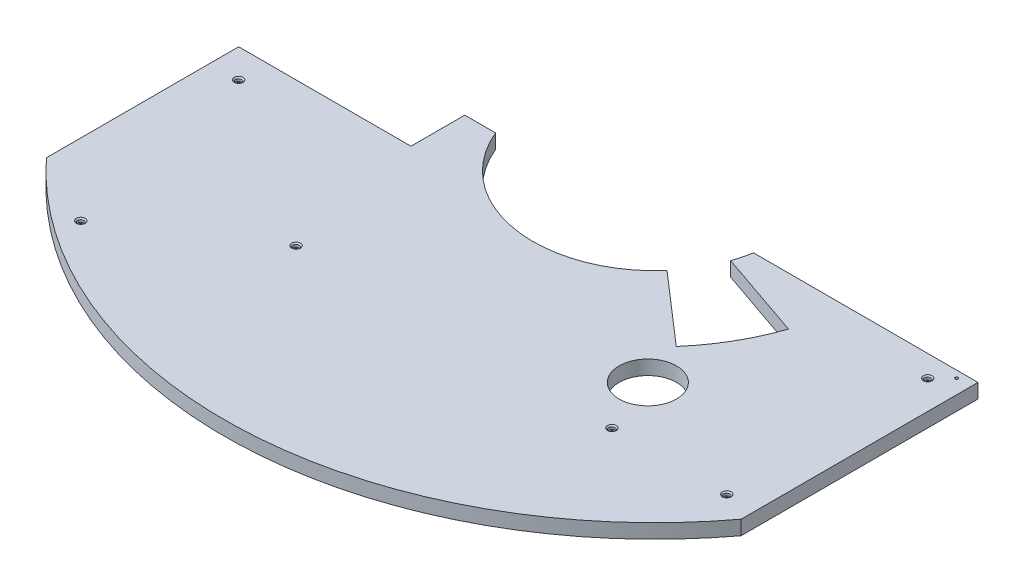
ISO-10303-21;
HEADER;
FILE_DESCRIPTION(('STEP AP214'),'2;1');
FILE_NAME('part.step','',(''),(''),'','','');
FILE_SCHEMA(('AUTOMOTIVE_DESIGN { 1 0 10303 214 1 1 1 1 }'));
ENDSEC;
DATA;
#1=APPLICATION_CONTEXT('core data for automotive mechanical design processes');
#2=APPLICATION_PROTOCOL_DEFINITION('international standard','automotive_design',2000,#1);
#3=PRODUCT_CONTEXT('',#1,'mechanical');
#4=PRODUCT('Part','Part','',(#3));
#5=PRODUCT_RELATED_PRODUCT_CATEGORY('part','',(#4));
#6=PRODUCT_DEFINITION_FORMATION('','',#4);
#7=PRODUCT_DEFINITION_CONTEXT('part definition',#1,'design');
#8=PRODUCT_DEFINITION('design','',#6,#7);
#9=PRODUCT_DEFINITION_SHAPE('','',#8);
#10=(LENGTH_UNIT() NAMED_UNIT(*) SI_UNIT(.MILLI.,.METRE.));
#11=(NAMED_UNIT(*) PLANE_ANGLE_UNIT() SI_UNIT($,.RADIAN.));
#12=(NAMED_UNIT(*) SI_UNIT($,.STERADIAN.) SOLID_ANGLE_UNIT());
#13=UNCERTAINTY_MEASURE_WITH_UNIT(LENGTH_MEASURE(1.E-05),#10,'distance_accuracy_value','');
#14=(GEOMETRIC_REPRESENTATION_CONTEXT(3) GLOBAL_UNCERTAINTY_ASSIGNED_CONTEXT((#13)) GLOBAL_UNIT_ASSIGNED_CONTEXT((#10,
#11,#12)) REPRESENTATION_CONTEXT('',''));
#15=CARTESIAN_POINT('',(0.,0.,0.));
#16=DIRECTION('',(0.,0.,1.));
#17=DIRECTION('',(1.,0.,0.));
#18=AXIS2_PLACEMENT_3D('',#15,#16,#17);
#19=CARTESIAN_POINT('',(152.22024857908,0.,-524.454782608696));
#20=DIRECTION('',(0.,1.,0.));
#21=DIRECTION('',(0.,0.,1.));
#22=AXIS2_PLACEMENT_3D('',#19,#20,#21);
#23=CYLINDRICAL_SURFACE('',#22,215.9);
#24=CARTESIAN_POINT('',(152.22024857908,25.4,-524.454782608696));
#25=DIRECTION('',(0.,1.,0.));
#26=DIRECTION('',(0.,0.,1.));
#27=AXIS2_PLACEMENT_3D('',#24,#25,#26);
#28=CIRCLE('',#27,215.9);
#29=CARTESIAN_POINT('',(-47.2748829404633,25.4,-441.904782608696));
#30=VERTEX_POINT('',#29);
#31=CARTESIAN_POINT('',(315.162046949177,25.4,-382.811638249646));
#32=VERTEX_POINT('',#31);
#33=EDGE_CURVE('E206',#30,#32,#28,.T.);
#34=ORIENTED_EDGE('',*,*,#33,.T.);
#35=DIRECTION('',(0.,1.,0.));
#36=VECTOR('',#35,1.);
#37=CARTESIAN_POINT('',(315.162046949177,0.,-382.811638249646));
#38=LINE('',#37,#36);
#39=CARTESIAN_POINT('',(315.162046949177,0.,-382.811638249646));
#40=VERTEX_POINT('',#39);
#41=EDGE_CURVE('E11',#32,#40,#38,.F.);
#42=ORIENTED_EDGE('',*,*,#41,.T.);
#43=CARTESIAN_POINT('',(152.22024857908,0.,-524.454782608696));
#44=DIRECTION('',(0.,1.,0.));
#45=DIRECTION('',(0.,0.,1.));
#46=AXIS2_PLACEMENT_3D('',#43,#44,#45);
#47=CIRCLE('',#46,215.9);
#48=CARTESIAN_POINT('',(-47.2748829404633,0.,-441.904782608696));
#49=VERTEX_POINT('',#48);
#50=EDGE_CURVE('E201',#49,#40,#47,.T.);
#51=ORIENTED_EDGE('',*,*,#50,.F.);
#52=DIRECTION('',(0.,1.,0.));
#53=VECTOR('',#52,1.);
#54=CARTESIAN_POINT('',(-47.2748829404633,0.,-441.904782608696));
#55=LINE('',#54,#53);
#56=EDGE_CURVE('E227',#49,#30,#55,.T.);
#57=ORIENTED_EDGE('',*,*,#56,.T.);
#58=EDGE_LOOP('',(#34,#42,#51,#57));
#59=FACE_BOUND('',#58,.T.);
#60=ADVANCED_FACE('F34',(#59),#23,.F.);
#61=CARTESIAN_POINT('',(-406.57975142092,25.4,-524.454782608696));
#62=DIRECTION('',(1.,0.,0.));
#63=DIRECTION('',(0.,0.,-1.));
#64=AXIS2_PLACEMENT_3D('',#61,#62,#63);
#65=PLANE('',#64);
#66=DIRECTION('',(0.,0.,1.));
#67=VECTOR('',#66,1.);
#68=CARTESIAN_POINT('',(-406.57975142092,0.,-524.454782608696));
#69=LINE('',#68,#67);
#70=CARTESIAN_POINT('',(-406.57975142092,0.,-346.654782608696));
#71=VERTEX_POINT('',#70);
#72=CARTESIAN_POINT('',(-406.57975142092,0.,-6.39440002766822));
#73=VERTEX_POINT('',#72);
#74=EDGE_CURVE('E221',#71,#73,#69,.T.);
#75=ORIENTED_EDGE('',*,*,#74,.T.);
#76=DIRECTION('',(0.,1.,0.));
#77=VECTOR('',#76,1.);
#78=CARTESIAN_POINT('',(-406.57975142092,0.,-6.39440002766822));
#79=LINE('',#78,#77);
#80=CARTESIAN_POINT('',(-406.57975142092,25.4,-6.39440002766822));
#81=VERTEX_POINT('',#80);
#82=EDGE_CURVE('E49',#73,#81,#79,.T.);
#83=ORIENTED_EDGE('',*,*,#82,.T.);
#84=DIRECTION('',(0.,0.,1.));
#85=VECTOR('',#84,1.);
#86=CARTESIAN_POINT('',(-406.57975142092,25.4,-524.454782608696));
#87=LINE('',#86,#85);
#88=CARTESIAN_POINT('',(-406.57975142092,25.4,-346.654782608696));
#89=VERTEX_POINT('',#88);
#90=EDGE_CURVE('E224',#89,#81,#87,.T.);
#91=ORIENTED_EDGE('',*,*,#90,.F.);
#92=DIRECTION('',(0.,1.,0.));
#93=VECTOR('',#92,1.);
#94=CARTESIAN_POINT('',(-406.57975142092,0.,-346.654782608696));
#95=LINE('',#94,#93);
#96=EDGE_CURVE('E187',#71,#89,#95,.T.);
#97=ORIENTED_EDGE('',*,*,#96,.F.);
#98=EDGE_LOOP('',(#75,#83,#91,#97));
#99=FACE_BOUND('',#98,.T.);
#100=ADVANCED_FACE('F36',(#99),#65,.F.);
#101=CARTESIAN_POINT('',(0.,25.4,0.));
#102=DIRECTION('',(0.,1.,0.));
#103=DIRECTION('',(0.,0.,1.));
#104=AXIS2_PLACEMENT_3D('',#101,#102,#103);
#105=PLANE('',#104);
#106=CARTESIAN_POINT('',(-50.9797514209197,25.4,-92.6547826086957));
#107=DIRECTION('',(0.,1.,0.));
#108=DIRECTION('',(0.,0.,1.));
#109=AXIS2_PLACEMENT_3D('',#106,#107,#108);
#110=CIRCLE('',#109,7.77875);
#111=CARTESIAN_POINT('',(-50.9797514209197,25.4,-84.8760326086957));
#112=VERTEX_POINT('',#111);
#113=EDGE_CURVE('E402',#112,#112,#110,.T.);
#114=ORIENTED_EDGE('',*,*,#113,.F.);
#115=EDGE_LOOP('',(#114));
#116=FACE_BOUND('',#115,.T.);
#117=CARTESIAN_POINT('',(507.82024857908,25.4,-92.6547826086957));
#118=DIRECTION('',(0.,1.,0.));
#119=DIRECTION('',(0.,0.,1.));
#120=AXIS2_PLACEMENT_3D('',#117,#118,#119);
#121=CIRCLE('',#120,7.77874999999995);
#122=CARTESIAN_POINT('',(507.82024857908,25.4,-84.8760326086958));
#123=VERTEX_POINT('',#122);
#124=EDGE_CURVE('E416',#123,#123,#121,.T.);
#125=ORIENTED_EDGE('',*,*,#124,.F.);
#126=EDGE_LOOP('',(#125));
#127=FACE_BOUND('',#126,.T.);
#128=CARTESIAN_POINT('',(-355.77975142092,25.4,-295.854782608696));
#129=DIRECTION('',(0.,1.,0.));
#130=DIRECTION('',(0.,0.,1.));
#131=AXIS2_PLACEMENT_3D('',#128,#129,#130);
#132=CIRCLE('',#131,7.77875);
#133=CARTESIAN_POINT('',(-355.77975142092,25.4,-288.076032608696));
#134=VERTEX_POINT('',#133);
#135=EDGE_CURVE('E431',#134,#134,#132,.T.);
#136=ORIENTED_EDGE('',*,*,#135,.F.);
#137=EDGE_LOOP('',(#136));
#138=FACE_BOUND('',#137,.T.);
#139=CARTESIAN_POINT('',(-279.57975142092,25.4,59.7452173913043));
#140=DIRECTION('',(0.,1.,0.));
#141=DIRECTION('',(0.,0.,1.));
#142=AXIS2_PLACEMENT_3D('',#139,#140,#141);
#143=CIRCLE('',#142,7.77875);
#144=CARTESIAN_POINT('',(-279.57975142092,25.4,67.5239673913043));
#145=VERTEX_POINT('',#144);
#146=EDGE_CURVE('E446',#145,#145,#143,.T.);
#147=ORIENTED_EDGE('',*,*,#146,.F.);
#148=EDGE_LOOP('',(#147));
#149=FACE_BOUND('',#148,.T.);
#150=CARTESIAN_POINT('',(711.020248579081,25.4,-448.254782608696));
#151=DIRECTION('',(0.,1.,0.));
#152=DIRECTION('',(0.,0.,1.));
#153=AXIS2_PLACEMENT_3D('',#150,#151,#152);
#154=CIRCLE('',#153,7.77874999999995);
#155=CARTESIAN_POINT('',(711.020248579081,25.4,-440.476032608696));
#156=VERTEX_POINT('',#155);
#157=EDGE_CURVE('E461',#156,#156,#154,.T.);
#158=ORIENTED_EDGE('',*,*,#157,.F.);
#159=EDGE_LOOP('',(#158));
#160=FACE_BOUND('',#159,.T.);
#161=CARTESIAN_POINT('',(711.020248579081,25.4,-92.6547826086957));
#162=DIRECTION('',(0.,1.,0.));
#163=DIRECTION('',(0.,0.,1.));
#164=AXIS2_PLACEMENT_3D('',#161,#162,#163);
#165=CIRCLE('',#164,7.77874999999995);
#166=CARTESIAN_POINT('',(711.020248579081,25.4,-84.8760326086958));
#167=VERTEX_POINT('',#166);
#168=EDGE_CURVE('E476',#167,#167,#165,.T.);
#169=ORIENTED_EDGE('',*,*,#168,.F.);
#170=EDGE_LOOP('',(#169));
#171=FACE_BOUND('',#170,.T.);
#172=CARTESIAN_POINT('',(152.22024857908,25.4,-524.454782608696));
#173=DIRECTION('',(0.,-1.,0.));
#174=DIRECTION('',(0.,0.,1.));
#175=AXIS2_PLACEMENT_3D('',#172,#173,#174);
#176=CIRCLE('',#175,762.);
#177=CARTESIAN_POINT('',(761.820248579081,25.4,-67.2547826086957));
#178=VERTEX_POINT('',#177);
#179=EDGE_CURVE('E129',#178,#81,#176,.T.);
#180=ORIENTED_EDGE('',*,*,#179,.F.);
#181=DIRECTION('',(0.,0.,1.));
#182=VECTOR('',#181,1.);
#183=CARTESIAN_POINT('',(761.820248579081,25.4,-67.2547826086957));
#184=LINE('',#183,#182);
#185=CARTESIAN_POINT('',(761.820248579081,25.4,-486.354782608696));
#186=VERTEX_POINT('',#185);
#187=EDGE_CURVE('E137',#186,#178,#184,.T.);
#188=ORIENTED_EDGE('',*,*,#187,.F.);
#189=DIRECTION('',(1.,0.,0.));
#190=VECTOR('',#189,1.);
#191=CARTESIAN_POINT('',(364.731895318735,25.4,-486.354782608696));
#192=LINE('',#191,#190);
#193=CARTESIAN_POINT('',(364.731895318735,25.4,-486.354782608696));
#194=VERTEX_POINT('',#193);
#195=EDGE_CURVE('E214',#194,#186,#192,.T.);
#196=ORIENTED_EDGE('',*,*,#195,.F.);
#197=CARTESIAN_POINT('',(356.357709050973,25.4,-454.164618061396));
#198=VERTEX_POINT('',#197);
#199=EDGE_CURVE('E199',#198,#194,#28,.T.);
#200=ORIENTED_EDGE('',*,*,#199,.F.);
#201=DIRECTION('',(-0.945518575599317,0.,-0.325568154457157));
#202=VECTOR('',#201,1.);
#203=CARTESIAN_POINT('',(512.46282588242,25.4,-400.413315760519));
#204=LINE('',#203,#202);
#205=CARTESIAN_POINT('',(512.46282588242,25.4,-400.413315760519));
#206=VERTEX_POINT('',#205);
#207=EDGE_CURVE('E57',#206,#198,#204,.T.);
#208=ORIENTED_EDGE('',*,*,#207,.F.);
#209=CARTESIAN_POINT('',(152.22024857908,25.4,-524.454782608696));
#210=DIRECTION('',(0.,1.,0.));
#211=DIRECTION('',(0.,0.,1.));
#212=AXIS2_PLACEMENT_3D('',#209,#210,#211);
#213=CIRCLE('',#212,381.);
#214=CARTESIAN_POINT('',(439.764598643958,25.4,-274.496292563314));
#215=VERTEX_POINT('',#214);
#216=EDGE_CURVE('E164',#215,#206,#213,.T.);
#217=ORIENTED_EDGE('',*,*,#216,.F.);
#218=DIRECTION('',(0.754709580222775,0.,0.656059028990503));
#219=VECTOR('',#218,1.);
#220=CARTESIAN_POINT('',(152.22024857908,25.4,-524.454782608696));
#221=LINE('',#220,#219);
#222=EDGE_CURVE('E152',#32,#215,#221,.T.);
#223=ORIENTED_EDGE('',*,*,#222,.F.);
#224=ORIENTED_EDGE('',*,*,#33,.F.);
#225=DIRECTION('',(1.,0.,0.));
#226=VECTOR('',#225,1.);
#227=CARTESIAN_POINT('',(-406.57975142092,25.4,-441.904782608696));
#228=LINE('',#227,#226);
#229=CARTESIAN_POINT('',(-101.77975142092,25.4,-441.904782608696));
#230=VERTEX_POINT('',#229);
#231=EDGE_CURVE('E194',#230,#30,#228,.T.);
#232=ORIENTED_EDGE('',*,*,#231,.F.);
#233=DIRECTION('',(0.,0.,-1.));
#234=VECTOR('',#233,1.);
#235=CARTESIAN_POINT('',(-101.77975142092,25.4,-346.654782608696));
#236=LINE('',#235,#234);
#237=CARTESIAN_POINT('',(-101.77975142092,25.4,-346.654782608696));
#238=VERTEX_POINT('',#237);
#239=EDGE_CURVE('E170',#238,#230,#236,.T.);
#240=ORIENTED_EDGE('',*,*,#239,.F.);
#241=DIRECTION('',(1.,0.,0.));
#242=VECTOR('',#241,1.);
#243=CARTESIAN_POINT('',(-101.77975142092,25.4,-346.654782608696));
#244=LINE('',#243,#242);
#245=EDGE_CURVE('E177',#89,#238,#244,.T.);
#246=ORIENTED_EDGE('',*,*,#245,.F.);
#247=ORIENTED_EDGE('',*,*,#90,.T.);
#248=EDGE_LOOP('',(#180,#188,#196,#200,#208,#217,#223,#224,#232,#240,#246,#247));
#249=FACE_BOUND('',#248,.T.);
#250=CARTESIAN_POINT('',(469.72024857908,25.4,-194.254782608696));
#251=DIRECTION('',(0.,1.,0.));
#252=DIRECTION('',(0.,0.,1.));
#253=AXIS2_PLACEMENT_3D('',#250,#251,#252);
#254=CIRCLE('',#253,50.8000000000001);
#255=CARTESIAN_POINT('',(469.72024857908,25.4,-143.454782608696));
#256=VERTEX_POINT('',#255);
#257=EDGE_CURVE('E186',#256,#256,#254,.T.);
#258=ORIENTED_EDGE('',*,*,#257,.F.);
#259=EDGE_LOOP('',(#258));
#260=FACE_BOUND('',#259,.T.);
#261=CARTESIAN_POINT('',(736.420248579081,25.4,-473.948827926415));
#262=DIRECTION('',(0.,1.,0.));
#263=DIRECTION('',(0.,0.,1.));
#264=AXIS2_PLACEMENT_3D('',#261,#262,#263);
#265=CIRCLE('',#264,2.55269999999996);
#266=CARTESIAN_POINT('',(736.420248579081,25.4,-471.396127926415));
#267=VERTEX_POINT('',#266);
#268=EDGE_CURVE('E204',#267,#267,#265,.T.);
#269=ORIENTED_EDGE('',*,*,#268,.F.);
#270=EDGE_LOOP('',(#269));
#271=FACE_BOUND('',#270,.T.);
#272=ADVANCED_FACE('F238',(#116,#127,#138,#149,#160,#171,#249,#260,#271),#105,.T.);
#273=CARTESIAN_POINT('',(0.,0.,0.));
#274=DIRECTION('',(0.,1.,0.));
#275=DIRECTION('',(0.,0.,1.));
#276=AXIS2_PLACEMENT_3D('',#273,#274,#275);
#277=PLANE('',#276);
#278=CARTESIAN_POINT('',(-50.9797514209197,0.,-92.6547826086957));
#279=DIRECTION('',(0.,1.,0.));
#280=DIRECTION('',(0.,0.,1.));
#281=AXIS2_PLACEMENT_3D('',#278,#279,#280);
#282=CIRCLE('',#281,3.37819999999999);
#283=CARTESIAN_POINT('',(-50.9797514209197,0.,-89.2765826086957));
#284=VERTEX_POINT('',#283);
#285=EDGE_CURVE('E413',#284,#284,#282,.T.);
#286=ORIENTED_EDGE('',*,*,#285,.T.);
#287=EDGE_LOOP('',(#286));
#288=FACE_BOUND('',#287,.T.);
#289=CARTESIAN_POINT('',(507.82024857908,0.,-92.6547826086957));
#290=DIRECTION('',(0.,1.,0.));
#291=DIRECTION('',(0.,0.,1.));
#292=AXIS2_PLACEMENT_3D('',#289,#290,#291);
#293=CIRCLE('',#292,3.3782);
#294=CARTESIAN_POINT('',(507.82024857908,0.,-89.2765826086957));
#295=VERTEX_POINT('',#294);
#296=EDGE_CURVE('E428',#295,#295,#293,.T.);
#297=ORIENTED_EDGE('',*,*,#296,.T.);
#298=EDGE_LOOP('',(#297));
#299=FACE_BOUND('',#298,.T.);
#300=CARTESIAN_POINT('',(-355.77975142092,0.,-295.854782608696));
#301=DIRECTION('',(0.,1.,0.));
#302=DIRECTION('',(0.,0.,1.));
#303=AXIS2_PLACEMENT_3D('',#300,#301,#302);
#304=CIRCLE('',#303,3.3782);
#305=CARTESIAN_POINT('',(-355.77975142092,0.,-292.476582608696));
#306=VERTEX_POINT('',#305);
#307=EDGE_CURVE('E443',#306,#306,#304,.T.);
#308=ORIENTED_EDGE('',*,*,#307,.T.);
#309=EDGE_LOOP('',(#308));
#310=FACE_BOUND('',#309,.T.);
#311=CARTESIAN_POINT('',(-279.57975142092,0.,59.7452173913043));
#312=DIRECTION('',(0.,1.,0.));
#313=DIRECTION('',(0.,0.,1.));
#314=AXIS2_PLACEMENT_3D('',#311,#312,#313);
#315=CIRCLE('',#314,3.3782);
#316=CARTESIAN_POINT('',(-279.57975142092,0.,63.1234173913043));
#317=VERTEX_POINT('',#316);
#318=EDGE_CURVE('E458',#317,#317,#315,.T.);
#319=ORIENTED_EDGE('',*,*,#318,.T.);
#320=EDGE_LOOP('',(#319));
#321=FACE_BOUND('',#320,.T.);
#322=CARTESIAN_POINT('',(711.020248579081,0.,-448.254782608696));
#323=DIRECTION('',(0.,1.,0.));
#324=DIRECTION('',(0.,0.,1.));
#325=AXIS2_PLACEMENT_3D('',#322,#323,#324);
#326=CIRCLE('',#325,3.3782);
#327=CARTESIAN_POINT('',(711.020248579081,0.,-444.876582608696));
#328=VERTEX_POINT('',#327);
#329=EDGE_CURVE('E473',#328,#328,#326,.T.);
#330=ORIENTED_EDGE('',*,*,#329,.T.);
#331=EDGE_LOOP('',(#330));
#332=FACE_BOUND('',#331,.T.);
#333=CARTESIAN_POINT('',(711.020248579081,0.,-92.6547826086957));
#334=DIRECTION('',(0.,1.,0.));
#335=DIRECTION('',(0.,0.,1.));
#336=AXIS2_PLACEMENT_3D('',#333,#334,#335);
#337=CIRCLE('',#336,3.3782);
#338=CARTESIAN_POINT('',(711.020248579081,0.,-89.2765826086957));
#339=VERTEX_POINT('',#338);
#340=EDGE_CURVE('E145',#339,#339,#337,.T.);
#341=ORIENTED_EDGE('',*,*,#340,.T.);
#342=EDGE_LOOP('',(#341));
#343=FACE_BOUND('',#342,.T.);
#344=DIRECTION('',(0.,0.,1.));
#345=VECTOR('',#344,1.);
#346=CARTESIAN_POINT('',(761.820248579081,0.,-67.2547826086957));
#347=LINE('',#346,#345);
#348=CARTESIAN_POINT('',(761.820248579081,0.,-486.354782608696));
#349=VERTEX_POINT('',#348);
#350=CARTESIAN_POINT('',(761.820248579081,0.,-67.2547826086957));
#351=VERTEX_POINT('',#350);
#352=EDGE_CURVE('E134',#349,#351,#347,.T.);
#353=ORIENTED_EDGE('',*,*,#352,.T.);
#354=CARTESIAN_POINT('',(152.22024857908,0.,-524.454782608696));
#355=DIRECTION('',(0.,-1.,0.));
#356=DIRECTION('',(0.,0.,1.));
#357=AXIS2_PLACEMENT_3D('',#354,#355,#356);
#358=CIRCLE('',#357,762.);
#359=EDGE_CURVE('E121',#351,#73,#358,.T.);
#360=ORIENTED_EDGE('',*,*,#359,.T.);
#361=ORIENTED_EDGE('',*,*,#74,.F.);
#362=DIRECTION('',(1.,0.,0.));
#363=VECTOR('',#362,1.);
#364=CARTESIAN_POINT('',(-101.77975142092,0.,-346.654782608696));
#365=LINE('',#364,#363);
#366=CARTESIAN_POINT('',(-101.77975142092,0.,-346.654782608696));
#367=VERTEX_POINT('',#366);
#368=EDGE_CURVE('E176',#71,#367,#365,.T.);
#369=ORIENTED_EDGE('',*,*,#368,.T.);
#370=DIRECTION('',(0.,0.,-1.));
#371=VECTOR('',#370,1.);
#372=CARTESIAN_POINT('',(-101.77975142092,0.,-346.654782608696));
#373=LINE('',#372,#371);
#374=CARTESIAN_POINT('',(-101.77975142092,0.,-441.904782608696));
#375=VERTEX_POINT('',#374);
#376=EDGE_CURVE('E173',#367,#375,#373,.T.);
#377=ORIENTED_EDGE('',*,*,#376,.T.);
#378=DIRECTION('',(1.,0.,0.));
#379=VECTOR('',#378,1.);
#380=CARTESIAN_POINT('',(-406.57975142092,0.,-441.904782608696));
#381=LINE('',#380,#379);
#382=EDGE_CURVE('E197',#375,#49,#381,.T.);
#383=ORIENTED_EDGE('',*,*,#382,.T.);
#384=ORIENTED_EDGE('',*,*,#50,.T.);
#385=DIRECTION('',(0.754709580222775,0.,0.656059028990503));
#386=VECTOR('',#385,1.);
#387=CARTESIAN_POINT('',(152.22024857908,0.,-524.454782608696));
#388=LINE('',#387,#386);
#389=CARTESIAN_POINT('',(439.764598643958,0.,-274.496292563314));
#390=VERTEX_POINT('',#389);
#391=EDGE_CURVE('E153',#40,#390,#388,.T.);
#392=ORIENTED_EDGE('',*,*,#391,.T.);
#393=CARTESIAN_POINT('',(152.22024857908,0.,-524.454782608696));
#394=DIRECTION('',(0.,1.,0.));
#395=DIRECTION('',(0.,0.,1.));
#396=AXIS2_PLACEMENT_3D('',#393,#394,#395);
#397=CIRCLE('',#396,381.);
#398=CARTESIAN_POINT('',(512.46282588242,0.,-400.413315760519));
#399=VERTEX_POINT('',#398);
#400=EDGE_CURVE('E156',#390,#399,#397,.T.);
#401=ORIENTED_EDGE('',*,*,#400,.T.);
#402=DIRECTION('',(-0.945518575599317,0.,-0.325568154457157));
#403=VECTOR('',#402,1.);
#404=CARTESIAN_POINT('',(512.46282588242,0.,-400.413315760519));
#405=LINE('',#404,#403);
#406=CARTESIAN_POINT('',(356.357709050973,0.,-454.164618061396));
#407=VERTEX_POINT('',#406);
#408=EDGE_CURVE('E159',#399,#407,#405,.T.);
#409=ORIENTED_EDGE('',*,*,#408,.T.);
#410=CARTESIAN_POINT('',(364.731895318735,0.,-486.354782608696));
#411=VERTEX_POINT('',#410);
#412=EDGE_CURVE('E205',#407,#411,#47,.T.);
#413=ORIENTED_EDGE('',*,*,#412,.T.);
#414=DIRECTION('',(1.,0.,0.));
#415=VECTOR('',#414,1.);
#416=CARTESIAN_POINT('',(364.731895318735,0.,-486.354782608696));
#417=LINE('',#416,#415);
#418=EDGE_CURVE('E143',#411,#349,#417,.T.);
#419=ORIENTED_EDGE('',*,*,#418,.T.);
#420=EDGE_LOOP('',(#353,#360,#361,#369,#377,#383,#384,#392,#401,#409,#413,#419));
#421=FACE_BOUND('',#420,.T.);
#422=CARTESIAN_POINT('',(469.72024857908,0.,-194.254782608696));
#423=DIRECTION('',(0.,1.,0.));
#424=DIRECTION('',(0.,0.,1.));
#425=AXIS2_PLACEMENT_3D('',#422,#423,#424);
#426=CIRCLE('',#425,50.8000000000001);
#427=CARTESIAN_POINT('',(469.72024857908,0.,-143.454782608696));
#428=VERTEX_POINT('',#427);
#429=EDGE_CURVE('E191',#428,#428,#426,.T.);
#430=ORIENTED_EDGE('',*,*,#429,.T.);
#431=EDGE_LOOP('',(#430));
#432=FACE_BOUND('',#431,.T.);
#433=CARTESIAN_POINT('',(736.420248579081,0.,-473.948827926415));
#434=DIRECTION('',(0.,1.,0.));
#435=DIRECTION('',(0.,0.,1.));
#436=AXIS2_PLACEMENT_3D('',#433,#434,#435);
#437=CIRCLE('',#436,2.55269999999996);
#438=CARTESIAN_POINT('',(736.420248579081,0.,-471.396127926415));
#439=VERTEX_POINT('',#438);
#440=EDGE_CURVE('E211',#439,#439,#437,.T.);
#441=ORIENTED_EDGE('',*,*,#440,.T.);
#442=EDGE_LOOP('',(#441));
#443=FACE_BOUND('',#442,.T.);
#444=ADVANCED_FACE('F140',(#288,#299,#310,#321,#332,#343,#421,#432,#443),#277,.F.);
#445=CARTESIAN_POINT('',(364.731895318735,0.,-486.354782608696));
#446=DIRECTION('',(0.,0.,1.));
#447=DIRECTION('',(1.,0.,0.));
#448=AXIS2_PLACEMENT_3D('',#445,#446,#447);
#449=PLANE('',#448);
#450=ORIENTED_EDGE('',*,*,#195,.T.);
#451=DIRECTION('',(0.,1.,0.));
#452=VECTOR('',#451,1.);
#453=CARTESIAN_POINT('',(761.820248579081,0.,-486.354782608696));
#454=LINE('',#453,#452);
#455=EDGE_CURVE('E219',#349,#186,#454,.T.);
#456=ORIENTED_EDGE('',*,*,#455,.F.);
#457=ORIENTED_EDGE('',*,*,#418,.F.);
#458=DIRECTION('',(0.,1.,0.));
#459=VECTOR('',#458,1.);
#460=CARTESIAN_POINT('',(364.731895318735,0.,-486.354782608696));
#461=LINE('',#460,#459);
#462=EDGE_CURVE('E216',#411,#194,#461,.T.);
#463=ORIENTED_EDGE('',*,*,#462,.T.);
#464=EDGE_LOOP('',(#450,#456,#457,#463));
#465=FACE_BOUND('',#464,.T.);
#466=ADVANCED_FACE('F242',(#465),#449,.F.);
#467=CARTESIAN_POINT('',(736.420248579081,25.4,-473.948827926415));
#468=DIRECTION('',(0.,1.,0.));
#469=DIRECTION('',(0.,0.,1.));
#470=AXIS2_PLACEMENT_3D('',#467,#468,#469);
#471=CYLINDRICAL_SURFACE('',#470,2.55269999999996);
#472=ORIENTED_EDGE('',*,*,#440,.F.);
#473=EDGE_LOOP('',(#472));
#474=FACE_BOUND('',#473,.T.);
#475=ORIENTED_EDGE('',*,*,#268,.T.);
#476=EDGE_LOOP('',(#475));
#477=FACE_BOUND('',#476,.T.);
#478=ADVANCED_FACE('F244',(#474,#477),#471,.F.);
#479=ORIENTED_EDGE('',*,*,#412,.F.);
#480=DIRECTION('',(0.,1.,0.));
#481=VECTOR('',#480,1.);
#482=CARTESIAN_POINT('',(356.357709050973,0.,-454.164618061396));
#483=LINE('',#482,#481);
#484=EDGE_CURVE('E42',#407,#198,#483,.T.);
#485=ORIENTED_EDGE('',*,*,#484,.T.);
#486=ORIENTED_EDGE('',*,*,#199,.T.);
#487=ORIENTED_EDGE('',*,*,#462,.F.);
#488=EDGE_LOOP('',(#479,#485,#486,#487));
#489=FACE_BOUND('',#488,.T.);
#490=ADVANCED_FACE('F233',(#489),#23,.F.);
#491=CARTESIAN_POINT('',(-406.57975142092,0.,-441.904782608696));
#492=DIRECTION('',(0.,0.,1.));
#493=DIRECTION('',(1.,0.,0.));
#494=AXIS2_PLACEMENT_3D('',#491,#492,#493);
#495=PLANE('',#494);
#496=ORIENTED_EDGE('',*,*,#382,.F.);
#497=DIRECTION('',(0.,1.,0.));
#498=VECTOR('',#497,1.);
#499=CARTESIAN_POINT('',(-101.77975142092,0.,-441.904782608696));
#500=LINE('',#499,#498);
#501=EDGE_CURVE('E180',#375,#230,#500,.T.);
#502=ORIENTED_EDGE('',*,*,#501,.T.);
#503=ORIENTED_EDGE('',*,*,#231,.T.);
#504=ORIENTED_EDGE('',*,*,#56,.F.);
#505=EDGE_LOOP('',(#496,#502,#503,#504));
#506=FACE_BOUND('',#505,.T.);
#507=ADVANCED_FACE('F263',(#506),#495,.F.);
#508=CARTESIAN_POINT('',(469.72024857908,0.,-194.254782608696));
#509=DIRECTION('',(0.,1.,0.));
#510=DIRECTION('',(0.,0.,1.));
#511=AXIS2_PLACEMENT_3D('',#508,#509,#510);
#512=CYLINDRICAL_SURFACE('',#511,50.8000000000001);
#513=ORIENTED_EDGE('',*,*,#429,.F.);
#514=EDGE_LOOP('',(#513));
#515=FACE_BOUND('',#514,.T.);
#516=ORIENTED_EDGE('',*,*,#257,.T.);
#517=EDGE_LOOP('',(#516));
#518=FACE_BOUND('',#517,.T.);
#519=ADVANCED_FACE('F267',(#515,#518),#512,.F.);
#520=CARTESIAN_POINT('',(-101.77975142092,0.,-346.654782608696));
#521=DIRECTION('',(1.,0.,0.));
#522=DIRECTION('',(0.,0.,-1.));
#523=AXIS2_PLACEMENT_3D('',#520,#521,#522);
#524=PLANE('',#523);
#525=ORIENTED_EDGE('',*,*,#239,.T.);
#526=ORIENTED_EDGE('',*,*,#501,.F.);
#527=ORIENTED_EDGE('',*,*,#376,.F.);
#528=DIRECTION('',(0.,1.,0.));
#529=VECTOR('',#528,1.);
#530=CARTESIAN_POINT('',(-101.77975142092,0.,-346.654782608696));
#531=LINE('',#530,#529);
#532=EDGE_CURVE('E184',#367,#238,#531,.T.);
#533=ORIENTED_EDGE('',*,*,#532,.T.);
#534=EDGE_LOOP('',(#525,#526,#527,#533));
#535=FACE_BOUND('',#534,.T.);
#536=ADVANCED_FACE('F272',(#535),#524,.F.);
#537=CARTESIAN_POINT('',(-101.77975142092,0.,-346.654782608696));
#538=DIRECTION('',(0.,0.,1.));
#539=DIRECTION('',(1.,0.,0.));
#540=AXIS2_PLACEMENT_3D('',#537,#538,#539);
#541=PLANE('',#540);
#542=ORIENTED_EDGE('',*,*,#245,.T.);
#543=ORIENTED_EDGE('',*,*,#532,.F.);
#544=ORIENTED_EDGE('',*,*,#368,.F.);
#545=ORIENTED_EDGE('',*,*,#96,.T.);
#546=EDGE_LOOP('',(#542,#543,#544,#545));
#547=FACE_BOUND('',#546,.T.);
#548=ADVANCED_FACE('F279',(#547),#541,.F.);
#549=CARTESIAN_POINT('',(152.22024857908,0.,-524.454782608696));
#550=DIRECTION('',(-0.656059028990503,0.,0.754709580222775));
#551=DIRECTION('',(0.754709580222775,0.,0.656059028990503));
#552=AXIS2_PLACEMENT_3D('',#549,#550,#551);
#553=PLANE('',#552);
#554=ORIENTED_EDGE('',*,*,#222,.T.);
#555=DIRECTION('',(0.,1.,0.));
#556=VECTOR('',#555,1.);
#557=CARTESIAN_POINT('',(439.764598643958,0.,-274.496292563314));
#558=LINE('',#557,#556);
#559=EDGE_CURVE('E162',#390,#215,#558,.T.);
#560=ORIENTED_EDGE('',*,*,#559,.F.);
#561=ORIENTED_EDGE('',*,*,#391,.F.);
#562=ORIENTED_EDGE('',*,*,#41,.F.);
#563=EDGE_LOOP('',(#554,#560,#561,#562));
#564=FACE_BOUND('',#563,.T.);
#565=ADVANCED_FACE('F283',(#564),#553,.F.);
#566=CARTESIAN_POINT('',(512.46282588242,0.,-400.413315760519));
#567=DIRECTION('',(0.325568154457157,0.,-0.945518575599317));
#568=DIRECTION('',(-0.945518575599317,0.,-0.325568154457157));
#569=AXIS2_PLACEMENT_3D('',#566,#567,#568);
#570=PLANE('',#569);
#571=ORIENTED_EDGE('',*,*,#408,.F.);
#572=DIRECTION('',(0.,1.,0.));
#573=VECTOR('',#572,1.);
#574=CARTESIAN_POINT('',(512.46282588242,0.,-400.413315760519));
#575=LINE('',#574,#573);
#576=EDGE_CURVE('E168',#399,#206,#575,.T.);
#577=ORIENTED_EDGE('',*,*,#576,.T.);
#578=ORIENTED_EDGE('',*,*,#207,.T.);
#579=ORIENTED_EDGE('',*,*,#484,.F.);
#580=EDGE_LOOP('',(#571,#577,#578,#579));
#581=FACE_BOUND('',#580,.T.);
#582=ADVANCED_FACE('F287',(#581),#570,.F.);
#583=CARTESIAN_POINT('',(152.22024857908,0.,-524.454782608696));
#584=DIRECTION('',(0.,1.,0.));
#585=DIRECTION('',(0.,0.,1.));
#586=AXIS2_PLACEMENT_3D('',#583,#584,#585);
#587=CYLINDRICAL_SURFACE('',#586,381.);
#588=ORIENTED_EDGE('',*,*,#216,.T.);
#589=ORIENTED_EDGE('',*,*,#576,.F.);
#590=ORIENTED_EDGE('',*,*,#400,.F.);
#591=ORIENTED_EDGE('',*,*,#559,.T.);
#592=EDGE_LOOP('',(#588,#589,#590,#591));
#593=FACE_BOUND('',#592,.T.);
#594=ADVANCED_FACE('F289',(#593),#587,.F.);
#595=CARTESIAN_POINT('',(152.22024857908,0.,-524.454782608696));
#596=DIRECTION('',(0.,1.,0.));
#597=DIRECTION('',(0.,0.,1.));
#598=AXIS2_PLACEMENT_3D('',#595,#596,#597);
#599=CYLINDRICAL_SURFACE('',#598,762.);
#600=ORIENTED_EDGE('',*,*,#179,.T.);
#601=ORIENTED_EDGE('',*,*,#82,.F.);
#602=ORIENTED_EDGE('',*,*,#359,.F.);
#603=DIRECTION('',(0.,1.,0.));
#604=VECTOR('',#603,1.);
#605=CARTESIAN_POINT('',(761.820248579081,0.,-67.2547826086957));
#606=LINE('',#605,#604);
#607=EDGE_CURVE('E124',#351,#178,#606,.T.);
#608=ORIENTED_EDGE('',*,*,#607,.T.);
#609=EDGE_LOOP('',(#600,#601,#602,#608));
#610=FACE_BOUND('',#609,.T.);
#611=ADVANCED_FACE('F123',(#610),#599,.T.);
#612=CARTESIAN_POINT('',(761.820248579081,0.,-67.2547826086957));
#613=DIRECTION('',(-1.,0.,0.));
#614=DIRECTION('',(0.,0.,1.));
#615=AXIS2_PLACEMENT_3D('',#612,#613,#614);
#616=PLANE('',#615);
#617=ORIENTED_EDGE('',*,*,#187,.T.);
#618=ORIENTED_EDGE('',*,*,#607,.F.);
#619=ORIENTED_EDGE('',*,*,#352,.F.);
#620=ORIENTED_EDGE('',*,*,#455,.T.);
#621=EDGE_LOOP('',(#617,#618,#619,#620));
#622=FACE_BOUND('',#621,.T.);
#623=ADVANCED_FACE('F133',(#622),#616,.F.);
#624=CARTESIAN_POINT('',(711.020248579081,25.4,-92.6547826086957));
#625=DIRECTION('',(0.,1.,0.));
#626=DIRECTION('',(0.,0.,1.));
#627=AXIS2_PLACEMENT_3D('',#624,#625,#626);
#628=CYLINDRICAL_SURFACE('',#627,3.3782);
#629=ORIENTED_EDGE('',*,*,#340,.F.);
#630=EDGE_LOOP('',(#629));
#631=FACE_BOUND('',#630,.T.);
#632=CARTESIAN_POINT('',(711.020248579081,19.05,-92.6547826086957));
#633=DIRECTION('',(0.,1.,0.));
#634=DIRECTION('',(0.,0.,1.));
#635=AXIS2_PLACEMENT_3D('',#632,#633,#634);
#636=CIRCLE('',#635,3.3782);
#637=CARTESIAN_POINT('',(711.020248579081,19.05,-89.2765826086957));
#638=VERTEX_POINT('',#637);
#639=EDGE_CURVE('E484',#638,#638,#636,.T.);
#640=ORIENTED_EDGE('',*,*,#639,.T.);
#641=EDGE_LOOP('',(#640));
#642=FACE_BOUND('',#641,.T.);
#643=ADVANCED_FACE('F299',(#631,#642),#628,.F.);
#644=CARTESIAN_POINT('',(716.576498579081,19.05,-92.6547826086957));
#645=DIRECTION('',(0.,-1.,0.));
#646=DIRECTION('',(0.,0.,-1.));
#647=AXIS2_PLACEMENT_3D('',#644,#645,#646);
#648=PLANE('',#647);
#649=ORIENTED_EDGE('',*,*,#639,.F.);
#650=EDGE_LOOP('',(#649));
#651=FACE_BOUND('',#650,.T.);
#652=CARTESIAN_POINT('',(711.020248579081,19.05,-92.6547826086957));
#653=DIRECTION('',(0.,1.,0.));
#654=DIRECTION('',(0.,0.,1.));
#655=AXIS2_PLACEMENT_3D('',#652,#653,#654);
#656=CIRCLE('',#655,5.55625000000004);
#657=CARTESIAN_POINT('',(711.020248579081,19.05,-87.0985326086957));
#658=VERTEX_POINT('',#657);
#659=EDGE_CURVE('E482',#658,#658,#656,.T.);
#660=ORIENTED_EDGE('',*,*,#659,.T.);
#661=EDGE_LOOP('',(#660));
#662=FACE_BOUND('',#661,.T.);
#663=ADVANCED_FACE('F302',(#651,#662),#648,.F.);
#664=CARTESIAN_POINT('',(711.020248579081,25.4,-92.6547826086957));
#665=DIRECTION('',(0.,1.,0.));
#666=DIRECTION('',(0.,0.,1.));
#667=AXIS2_PLACEMENT_3D('',#664,#665,#666);
#668=CYLINDRICAL_SURFACE('',#667,5.55625000000004);
#669=ORIENTED_EDGE('',*,*,#659,.F.);
#670=EDGE_LOOP('',(#669));
#671=FACE_BOUND('',#670,.T.);
#672=CARTESIAN_POINT('',(711.020248579081,23.1775,-92.6547826086957));
#673=DIRECTION('',(0.,1.,0.));
#674=DIRECTION('',(0.,0.,1.));
#675=AXIS2_PLACEMENT_3D('',#672,#673,#674);
#676=CIRCLE('',#675,5.55625000000004);
#677=CARTESIAN_POINT('',(711.020248579081,23.1775,-87.0985326086957));
#678=VERTEX_POINT('',#677);
#679=EDGE_CURVE('E479',#678,#678,#676,.T.);
#680=ORIENTED_EDGE('',*,*,#679,.T.);
#681=EDGE_LOOP('',(#680));
#682=FACE_BOUND('',#681,.T.);
#683=ADVANCED_FACE('F306',(#671,#682),#668,.F.);
#684=CARTESIAN_POINT('',(711.020248579081,25.4,-92.6547826086957));
#685=DIRECTION('',(0.,1.,0.));
#686=DIRECTION('',(0.,0.,1.));
#687=AXIS2_PLACEMENT_3D('',#684,#685,#686);
#688=CONICAL_SURFACE('',#687,7.77874999999995,0.785398163397425);
#689=ORIENTED_EDGE('',*,*,#679,.F.);
#690=EDGE_LOOP('',(#689));
#691=FACE_BOUND('',#690,.T.);
#692=ORIENTED_EDGE('',*,*,#168,.T.);
#693=EDGE_LOOP('',(#692));
#694=FACE_BOUND('',#693,.T.);
#695=ADVANCED_FACE('F310',(#691,#694),#688,.F.);
#696=CARTESIAN_POINT('',(711.020248579081,25.4,-448.254782608696));
#697=DIRECTION('',(0.,1.,0.));
#698=DIRECTION('',(0.,0.,1.));
#699=AXIS2_PLACEMENT_3D('',#696,#697,#698);
#700=CYLINDRICAL_SURFACE('',#699,3.3782);
#701=ORIENTED_EDGE('',*,*,#329,.F.);
#702=EDGE_LOOP('',(#701));
#703=FACE_BOUND('',#702,.T.);
#704=CARTESIAN_POINT('',(711.020248579081,19.05,-448.254782608696));
#705=DIRECTION('',(0.,1.,0.));
#706=DIRECTION('',(0.,0.,1.));
#707=AXIS2_PLACEMENT_3D('',#704,#705,#706);
#708=CIRCLE('',#707,3.3782);
#709=CARTESIAN_POINT('',(711.020248579081,19.05,-444.876582608696));
#710=VERTEX_POINT('',#709);
#711=EDGE_CURVE('E470',#710,#710,#708,.T.);
#712=ORIENTED_EDGE('',*,*,#711,.T.);
#713=EDGE_LOOP('',(#712));
#714=FACE_BOUND('',#713,.T.);
#715=ADVANCED_FACE('F314',(#703,#714),#700,.F.);
#716=CARTESIAN_POINT('',(716.576498579081,19.05,-448.254782608696));
#717=DIRECTION('',(0.,-1.,0.));
#718=DIRECTION('',(0.,0.,-1.));
#719=AXIS2_PLACEMENT_3D('',#716,#717,#718);
#720=PLANE('',#719);
#721=ORIENTED_EDGE('',*,*,#711,.F.);
#722=EDGE_LOOP('',(#721));
#723=FACE_BOUND('',#722,.T.);
#724=CARTESIAN_POINT('',(711.020248579081,19.05,-448.254782608696));
#725=DIRECTION('',(0.,1.,0.));
#726=DIRECTION('',(0.,0.,1.));
#727=AXIS2_PLACEMENT_3D('',#724,#725,#726);
#728=CIRCLE('',#727,5.55625000000004);
#729=CARTESIAN_POINT('',(711.020248579081,19.05,-442.698532608696));
#730=VERTEX_POINT('',#729);
#731=EDGE_CURVE('E467',#730,#730,#728,.T.);
#732=ORIENTED_EDGE('',*,*,#731,.T.);
#733=EDGE_LOOP('',(#732));
#734=FACE_BOUND('',#733,.T.);
#735=ADVANCED_FACE('F318',(#723,#734),#720,.F.);
#736=CARTESIAN_POINT('',(711.020248579081,25.4,-448.254782608696));
#737=DIRECTION('',(0.,1.,0.));
#738=DIRECTION('',(0.,0.,1.));
#739=AXIS2_PLACEMENT_3D('',#736,#737,#738);
#740=CYLINDRICAL_SURFACE('',#739,5.55625000000004);
#741=ORIENTED_EDGE('',*,*,#731,.F.);
#742=EDGE_LOOP('',(#741));
#743=FACE_BOUND('',#742,.T.);
#744=CARTESIAN_POINT('',(711.020248579081,23.1775,-448.254782608696));
#745=DIRECTION('',(0.,1.,0.));
#746=DIRECTION('',(0.,0.,1.));
#747=AXIS2_PLACEMENT_3D('',#744,#745,#746);
#748=CIRCLE('',#747,5.55625000000004);
#749=CARTESIAN_POINT('',(711.020248579081,23.1775,-442.698532608696));
#750=VERTEX_POINT('',#749);
#751=EDGE_CURVE('E464',#750,#750,#748,.T.);
#752=ORIENTED_EDGE('',*,*,#751,.T.);
#753=EDGE_LOOP('',(#752));
#754=FACE_BOUND('',#753,.T.);
#755=ADVANCED_FACE('F322',(#743,#754),#740,.F.);
#756=CARTESIAN_POINT('',(711.020248579081,25.4,-448.254782608696));
#757=DIRECTION('',(0.,1.,0.));
#758=DIRECTION('',(0.,0.,1.));
#759=AXIS2_PLACEMENT_3D('',#756,#757,#758);
#760=CONICAL_SURFACE('',#759,7.77874999999995,0.785398163397425);
#761=ORIENTED_EDGE('',*,*,#751,.F.);
#762=EDGE_LOOP('',(#761));
#763=FACE_BOUND('',#762,.T.);
#764=ORIENTED_EDGE('',*,*,#157,.T.);
#765=EDGE_LOOP('',(#764));
#766=FACE_BOUND('',#765,.T.);
#767=ADVANCED_FACE('F326',(#763,#766),#760,.F.);
#768=CARTESIAN_POINT('',(-279.57975142092,25.4,59.7452173913043));
#769=DIRECTION('',(0.,1.,0.));
#770=DIRECTION('',(0.,0.,1.));
#771=AXIS2_PLACEMENT_3D('',#768,#769,#770);
#772=CYLINDRICAL_SURFACE('',#771,3.3782);
#773=ORIENTED_EDGE('',*,*,#318,.F.);
#774=EDGE_LOOP('',(#773));
#775=FACE_BOUND('',#774,.T.);
#776=CARTESIAN_POINT('',(-279.57975142092,19.05,59.7452173913043));
#777=DIRECTION('',(0.,1.,0.));
#778=DIRECTION('',(0.,0.,1.));
#779=AXIS2_PLACEMENT_3D('',#776,#777,#778);
#780=CIRCLE('',#779,3.3782);
#781=CARTESIAN_POINT('',(-279.57975142092,19.05,63.1234173913043));
#782=VERTEX_POINT('',#781);
#783=EDGE_CURVE('E455',#782,#782,#780,.T.);
#784=ORIENTED_EDGE('',*,*,#783,.T.);
#785=EDGE_LOOP('',(#784));
#786=FACE_BOUND('',#785,.T.);
#787=ADVANCED_FACE('F330',(#775,#786),#772,.F.);
#788=CARTESIAN_POINT('',(-274.02350142092,19.05,59.7452173913043));
#789=DIRECTION('',(0.,-1.,0.));
#790=DIRECTION('',(0.,0.,-1.));
#791=AXIS2_PLACEMENT_3D('',#788,#789,#790);
#792=PLANE('',#791);
#793=ORIENTED_EDGE('',*,*,#783,.F.);
#794=EDGE_LOOP('',(#793));
#795=FACE_BOUND('',#794,.T.);
#796=CARTESIAN_POINT('',(-279.57975142092,19.05,59.7452173913043));
#797=DIRECTION('',(0.,1.,0.));
#798=DIRECTION('',(0.,0.,1.));
#799=AXIS2_PLACEMENT_3D('',#796,#797,#798);
#800=CIRCLE('',#799,5.55624999999998);
#801=CARTESIAN_POINT('',(-279.57975142092,19.05,65.3014673913043));
#802=VERTEX_POINT('',#801);
#803=EDGE_CURVE('E452',#802,#802,#800,.T.);
#804=ORIENTED_EDGE('',*,*,#803,.T.);
#805=EDGE_LOOP('',(#804));
#806=FACE_BOUND('',#805,.T.);
#807=ADVANCED_FACE('F334',(#795,#806),#792,.F.);
#808=CARTESIAN_POINT('',(-279.57975142092,25.4,59.7452173913043));
#809=DIRECTION('',(0.,1.,0.));
#810=DIRECTION('',(0.,0.,1.));
#811=AXIS2_PLACEMENT_3D('',#808,#809,#810);
#812=CYLINDRICAL_SURFACE('',#811,5.55624999999998);
#813=ORIENTED_EDGE('',*,*,#803,.F.);
#814=EDGE_LOOP('',(#813));
#815=FACE_BOUND('',#814,.T.);
#816=CARTESIAN_POINT('',(-279.57975142092,23.1775,59.7452173913043));
#817=DIRECTION('',(0.,1.,0.));
#818=DIRECTION('',(0.,0.,1.));
#819=AXIS2_PLACEMENT_3D('',#816,#817,#818);
#820=CIRCLE('',#819,5.55624999999998);
#821=CARTESIAN_POINT('',(-279.57975142092,23.1775,65.3014673913043));
#822=VERTEX_POINT('',#821);
#823=EDGE_CURVE('E449',#822,#822,#820,.T.);
#824=ORIENTED_EDGE('',*,*,#823,.T.);
#825=EDGE_LOOP('',(#824));
#826=FACE_BOUND('',#825,.T.);
#827=ADVANCED_FACE('F338',(#815,#826),#812,.F.);
#828=CARTESIAN_POINT('',(-279.57975142092,25.4,59.7452173913043));
#829=DIRECTION('',(0.,1.,0.));
#830=DIRECTION('',(0.,0.,1.));
#831=AXIS2_PLACEMENT_3D('',#828,#829,#830);
#832=CONICAL_SURFACE('',#831,7.77875,0.78539816339745);
#833=ORIENTED_EDGE('',*,*,#823,.F.);
#834=EDGE_LOOP('',(#833));
#835=FACE_BOUND('',#834,.T.);
#836=ORIENTED_EDGE('',*,*,#146,.T.);
#837=EDGE_LOOP('',(#836));
#838=FACE_BOUND('',#837,.T.);
#839=ADVANCED_FACE('F342',(#835,#838),#832,.F.);
#840=CARTESIAN_POINT('',(-355.77975142092,25.4,-295.854782608696));
#841=DIRECTION('',(0.,1.,0.));
#842=DIRECTION('',(0.,0.,1.));
#843=AXIS2_PLACEMENT_3D('',#840,#841,#842);
#844=CYLINDRICAL_SURFACE('',#843,3.3782);
#845=ORIENTED_EDGE('',*,*,#307,.F.);
#846=EDGE_LOOP('',(#845));
#847=FACE_BOUND('',#846,.T.);
#848=CARTESIAN_POINT('',(-355.77975142092,19.05,-295.854782608696));
#849=DIRECTION('',(0.,1.,0.));
#850=DIRECTION('',(0.,0.,1.));
#851=AXIS2_PLACEMENT_3D('',#848,#849,#850);
#852=CIRCLE('',#851,3.3782);
#853=CARTESIAN_POINT('',(-355.77975142092,19.05,-292.476582608696));
#854=VERTEX_POINT('',#853);
#855=EDGE_CURVE('E440',#854,#854,#852,.T.);
#856=ORIENTED_EDGE('',*,*,#855,.T.);
#857=EDGE_LOOP('',(#856));
#858=FACE_BOUND('',#857,.T.);
#859=ADVANCED_FACE('F346',(#847,#858),#844,.F.);
#860=CARTESIAN_POINT('',(-350.22350142092,19.05,-295.854782608696));
#861=DIRECTION('',(0.,-1.,0.));
#862=DIRECTION('',(0.,0.,-1.));
#863=AXIS2_PLACEMENT_3D('',#860,#861,#862);
#864=PLANE('',#863);
#865=ORIENTED_EDGE('',*,*,#855,.F.);
#866=EDGE_LOOP('',(#865));
#867=FACE_BOUND('',#866,.T.);
#868=CARTESIAN_POINT('',(-355.77975142092,19.05,-295.854782608696));
#869=DIRECTION('',(0.,1.,0.));
#870=DIRECTION('',(0.,0.,1.));
#871=AXIS2_PLACEMENT_3D('',#868,#869,#870);
#872=CIRCLE('',#871,5.55624999999998);
#873=CARTESIAN_POINT('',(-355.77975142092,19.05,-290.298532608696));
#874=VERTEX_POINT('',#873);
#875=EDGE_CURVE('E437',#874,#874,#872,.T.);
#876=ORIENTED_EDGE('',*,*,#875,.T.);
#877=EDGE_LOOP('',(#876));
#878=FACE_BOUND('',#877,.T.);
#879=ADVANCED_FACE('F350',(#867,#878),#864,.F.);
#880=CARTESIAN_POINT('',(-355.77975142092,25.4,-295.854782608696));
#881=DIRECTION('',(0.,1.,0.));
#882=DIRECTION('',(0.,0.,1.));
#883=AXIS2_PLACEMENT_3D('',#880,#881,#882);
#884=CYLINDRICAL_SURFACE('',#883,5.55624999999998);
#885=ORIENTED_EDGE('',*,*,#875,.F.);
#886=EDGE_LOOP('',(#885));
#887=FACE_BOUND('',#886,.T.);
#888=CARTESIAN_POINT('',(-355.77975142092,23.1775,-295.854782608696));
#889=DIRECTION('',(0.,1.,0.));
#890=DIRECTION('',(0.,0.,1.));
#891=AXIS2_PLACEMENT_3D('',#888,#889,#890);
#892=CIRCLE('',#891,5.55624999999998);
#893=CARTESIAN_POINT('',(-355.77975142092,23.1775,-290.298532608696));
#894=VERTEX_POINT('',#893);
#895=EDGE_CURVE('E434',#894,#894,#892,.T.);
#896=ORIENTED_EDGE('',*,*,#895,.T.);
#897=EDGE_LOOP('',(#896));
#898=FACE_BOUND('',#897,.T.);
#899=ADVANCED_FACE('F354',(#887,#898),#884,.F.);
#900=CARTESIAN_POINT('',(-355.77975142092,25.4,-295.854782608696));
#901=DIRECTION('',(0.,1.,0.));
#902=DIRECTION('',(0.,0.,1.));
#903=AXIS2_PLACEMENT_3D('',#900,#901,#902);
#904=CONICAL_SURFACE('',#903,7.77875,0.78539816339745);
#905=ORIENTED_EDGE('',*,*,#895,.F.);
#906=EDGE_LOOP('',(#905));
#907=FACE_BOUND('',#906,.T.);
#908=ORIENTED_EDGE('',*,*,#135,.T.);
#909=EDGE_LOOP('',(#908));
#910=FACE_BOUND('',#909,.T.);
#911=ADVANCED_FACE('F358',(#907,#910),#904,.F.);
#912=CARTESIAN_POINT('',(507.82024857908,25.4,-92.6547826086957));
#913=DIRECTION('',(0.,1.,0.));
#914=DIRECTION('',(0.,0.,1.));
#915=AXIS2_PLACEMENT_3D('',#912,#913,#914);
#916=CYLINDRICAL_SURFACE('',#915,3.3782);
#917=ORIENTED_EDGE('',*,*,#296,.F.);
#918=EDGE_LOOP('',(#917));
#919=FACE_BOUND('',#918,.T.);
#920=CARTESIAN_POINT('',(507.82024857908,19.05,-92.6547826086957));
#921=DIRECTION('',(0.,1.,0.));
#922=DIRECTION('',(0.,0.,1.));
#923=AXIS2_PLACEMENT_3D('',#920,#921,#922);
#924=CIRCLE('',#923,3.3782);
#925=CARTESIAN_POINT('',(507.82024857908,19.05,-89.2765826086957));
#926=VERTEX_POINT('',#925);
#927=EDGE_CURVE('E425',#926,#926,#924,.T.);
#928=ORIENTED_EDGE('',*,*,#927,.T.);
#929=EDGE_LOOP('',(#928));
#930=FACE_BOUND('',#929,.T.);
#931=ADVANCED_FACE('F362',(#919,#930),#916,.F.);
#932=CARTESIAN_POINT('',(513.37649857908,19.05,-92.6547826086957));
#933=DIRECTION('',(0.,-1.,0.));
#934=DIRECTION('',(0.,0.,-1.));
#935=AXIS2_PLACEMENT_3D('',#932,#933,#934);
#936=PLANE('',#935);
#937=ORIENTED_EDGE('',*,*,#927,.F.);
#938=EDGE_LOOP('',(#937));
#939=FACE_BOUND('',#938,.T.);
#940=CARTESIAN_POINT('',(507.82024857908,19.05,-92.6547826086957));
#941=DIRECTION('',(0.,1.,0.));
#942=DIRECTION('',(0.,0.,1.));
#943=AXIS2_PLACEMENT_3D('',#940,#941,#942);
#944=CIRCLE('',#943,5.55625000000004);
#945=CARTESIAN_POINT('',(507.82024857908,19.05,-87.0985326086957));
#946=VERTEX_POINT('',#945);
#947=EDGE_CURVE('E422',#946,#946,#944,.T.);
#948=ORIENTED_EDGE('',*,*,#947,.T.);
#949=EDGE_LOOP('',(#948));
#950=FACE_BOUND('',#949,.T.);
#951=ADVANCED_FACE('F366',(#939,#950),#936,.F.);
#952=CARTESIAN_POINT('',(507.82024857908,25.4,-92.6547826086957));
#953=DIRECTION('',(0.,1.,0.));
#954=DIRECTION('',(0.,0.,1.));
#955=AXIS2_PLACEMENT_3D('',#952,#953,#954);
#956=CYLINDRICAL_SURFACE('',#955,5.55625000000004);
#957=ORIENTED_EDGE('',*,*,#947,.F.);
#958=EDGE_LOOP('',(#957));
#959=FACE_BOUND('',#958,.T.);
#960=CARTESIAN_POINT('',(507.82024857908,23.1775,-92.6547826086957));
#961=DIRECTION('',(0.,1.,0.));
#962=DIRECTION('',(0.,0.,1.));
#963=AXIS2_PLACEMENT_3D('',#960,#961,#962);
#964=CIRCLE('',#963,5.55625000000004);
#965=CARTESIAN_POINT('',(507.82024857908,23.1775,-87.0985326086957));
#966=VERTEX_POINT('',#965);
#967=EDGE_CURVE('E419',#966,#966,#964,.T.);
#968=ORIENTED_EDGE('',*,*,#967,.T.);
#969=EDGE_LOOP('',(#968));
#970=FACE_BOUND('',#969,.T.);
#971=ADVANCED_FACE('F370',(#959,#970),#956,.F.);
#972=CARTESIAN_POINT('',(507.82024857908,25.4,-92.6547826086957));
#973=DIRECTION('',(0.,1.,0.));
#974=DIRECTION('',(0.,0.,1.));
#975=AXIS2_PLACEMENT_3D('',#972,#973,#974);
#976=CONICAL_SURFACE('',#975,7.77874999999995,0.785398163397425);
#977=ORIENTED_EDGE('',*,*,#967,.F.);
#978=EDGE_LOOP('',(#977));
#979=FACE_BOUND('',#978,.T.);
#980=ORIENTED_EDGE('',*,*,#124,.T.);
#981=EDGE_LOOP('',(#980));
#982=FACE_BOUND('',#981,.T.);
#983=ADVANCED_FACE('F374',(#979,#982),#976,.F.);
#984=CARTESIAN_POINT('',(-50.9797514209197,25.4,-92.6547826086957));
#985=DIRECTION('',(0.,1.,0.));
#986=DIRECTION('',(0.,0.,1.));
#987=AXIS2_PLACEMENT_3D('',#984,#985,#986);
#988=CYLINDRICAL_SURFACE('',#987,3.3782);
#989=ORIENTED_EDGE('',*,*,#285,.F.);
#990=EDGE_LOOP('',(#989));
#991=FACE_BOUND('',#990,.T.);
#992=CARTESIAN_POINT('',(-50.9797514209197,19.05,-92.6547826086957));
#993=DIRECTION('',(0.,1.,0.));
#994=DIRECTION('',(0.,0.,1.));
#995=AXIS2_PLACEMENT_3D('',#992,#993,#994);
#996=CIRCLE('',#995,3.37820000000001);
#997=CARTESIAN_POINT('',(-50.9797514209197,19.05,-89.2765826086957));
#998=VERTEX_POINT('',#997);
#999=EDGE_CURVE('E410',#998,#998,#996,.T.);
#1000=ORIENTED_EDGE('',*,*,#999,.T.);
#1001=EDGE_LOOP('',(#1000));
#1002=FACE_BOUND('',#1001,.T.);
#1003=ADVANCED_FACE('F378',(#991,#1002),#988,.F.);
#1004=CARTESIAN_POINT('',(-45.4235014209197,19.05,-92.6547826086957));
#1005=DIRECTION('',(0.,-1.,0.));
#1006=DIRECTION('',(0.,0.,-1.));
#1007=AXIS2_PLACEMENT_3D('',#1004,#1005,#1006);
#1008=PLANE('',#1007);
#1009=ORIENTED_EDGE('',*,*,#999,.F.);
#1010=EDGE_LOOP('',(#1009));
#1011=FACE_BOUND('',#1010,.T.);
#1012=CARTESIAN_POINT('',(-50.9797514209197,19.05,-92.6547826086957));
#1013=DIRECTION('',(0.,1.,0.));
#1014=DIRECTION('',(0.,0.,1.));
#1015=AXIS2_PLACEMENT_3D('',#1012,#1013,#1014);
#1016=CIRCLE('',#1015,5.55625);
#1017=CARTESIAN_POINT('',(-50.9797514209197,19.05,-87.0985326086957));
#1018=VERTEX_POINT('',#1017);
#1019=EDGE_CURVE('E405',#1018,#1018,#1016,.T.);
#1020=ORIENTED_EDGE('',*,*,#1019,.T.);
#1021=EDGE_LOOP('',(#1020));
#1022=FACE_BOUND('',#1021,.T.);
#1023=ADVANCED_FACE('F382',(#1011,#1022),#1008,.F.);
#1024=CARTESIAN_POINT('',(-50.9797514209197,25.4,-92.6547826086957));
#1025=DIRECTION('',(0.,1.,0.));
#1026=DIRECTION('',(0.,0.,1.));
#1027=AXIS2_PLACEMENT_3D('',#1024,#1025,#1026);
#1028=CYLINDRICAL_SURFACE('',#1027,5.55625);
#1029=ORIENTED_EDGE('',*,*,#1019,.F.);
#1030=EDGE_LOOP('',(#1029));
#1031=FACE_BOUND('',#1030,.T.);
#1032=CARTESIAN_POINT('',(-50.9797514209197,23.1775,-92.6547826086957));
#1033=DIRECTION('',(0.,1.,0.));
#1034=DIRECTION('',(0.,0.,1.));
#1035=AXIS2_PLACEMENT_3D('',#1032,#1033,#1034);
#1036=CIRCLE('',#1035,5.55625);
#1037=CARTESIAN_POINT('',(-50.9797514209197,23.1775,-87.0985326086957));
#1038=VERTEX_POINT('',#1037);
#1039=EDGE_CURVE('E399',#1038,#1038,#1036,.T.);
#1040=ORIENTED_EDGE('',*,*,#1039,.T.);
#1041=EDGE_LOOP('',(#1040));
#1042=FACE_BOUND('',#1041,.T.);
#1043=ADVANCED_FACE('F386',(#1031,#1042),#1028,.F.);
#1044=CARTESIAN_POINT('',(-50.9797514209197,25.4,-92.6547826086957));
#1045=DIRECTION('',(0.,1.,0.));
#1046=DIRECTION('',(0.,0.,1.));
#1047=AXIS2_PLACEMENT_3D('',#1044,#1045,#1046);
#1048=CONICAL_SURFACE('',#1047,7.77875,0.785398163397447);
#1049=ORIENTED_EDGE('',*,*,#1039,.F.);
#1050=EDGE_LOOP('',(#1049));
#1051=FACE_BOUND('',#1050,.T.);
#1052=ORIENTED_EDGE('',*,*,#113,.T.);
#1053=EDGE_LOOP('',(#1052));
#1054=FACE_BOUND('',#1053,.T.);
#1055=ADVANCED_FACE('F390',(#1051,#1054),#1048,.F.);
#1056=CLOSED_SHELL('',(#60,#100,#272,#444,#466,#478,#490,#507,#519,#536,#548,#565,#582,#594,
#611,#623,#643,#663,#683,#695,#715,#735,#755,#767,#787,#807,#827,#839,#859,#879,#899,#911,#931,
#951,#971,#983,#1003,#1023,#1043,#1055));
#1057=MANIFOLD_SOLID_BREP('B2',#1056);
#1058=ADVANCED_BREP_SHAPE_REPRESENTATION('',(#18,#1057),#14);
#1059=SHAPE_DEFINITION_REPRESENTATION(#9,#1058);
ENDSEC;
END-ISO-10303-21;
